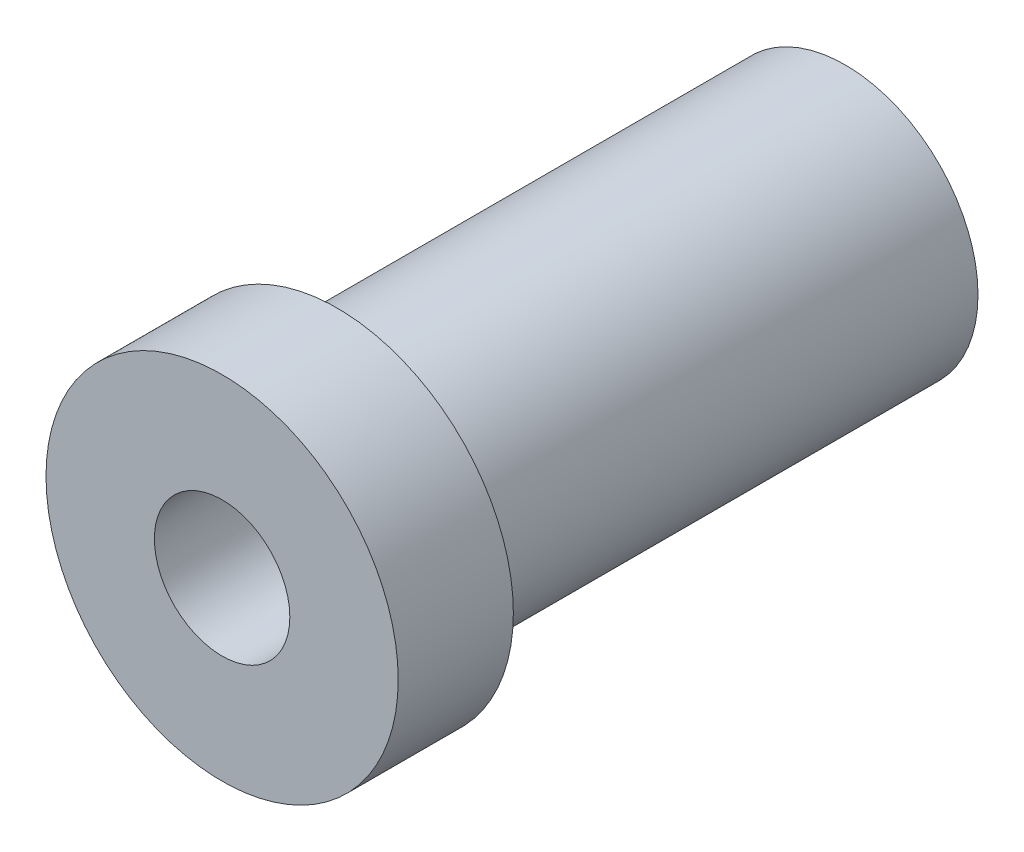
ISO-10303-21;
HEADER;
FILE_DESCRIPTION(('STEP AP214'),'2;1');
FILE_NAME('part.step','',(''),(''),'','','');
FILE_SCHEMA(('AUTOMOTIVE_DESIGN { 1 0 10303 214 1 1 1 1 }'));
ENDSEC;
DATA;
#1=APPLICATION_CONTEXT('core data for automotive mechanical design processes');
#2=APPLICATION_PROTOCOL_DEFINITION('international standard','automotive_design',2000,#1);
#3=PRODUCT_CONTEXT('',#1,'mechanical');
#4=PRODUCT('Part','Part','',(#3));
#5=PRODUCT_RELATED_PRODUCT_CATEGORY('part','',(#4));
#6=PRODUCT_DEFINITION_FORMATION('','',#4);
#7=PRODUCT_DEFINITION_CONTEXT('part definition',#1,'design');
#8=PRODUCT_DEFINITION('design','',#6,#7);
#9=PRODUCT_DEFINITION_SHAPE('','',#8);
#10=(LENGTH_UNIT() NAMED_UNIT(*) SI_UNIT(.MILLI.,.METRE.));
#11=(NAMED_UNIT(*) PLANE_ANGLE_UNIT() SI_UNIT($,.RADIAN.));
#12=(NAMED_UNIT(*) SI_UNIT($,.STERADIAN.) SOLID_ANGLE_UNIT());
#13=UNCERTAINTY_MEASURE_WITH_UNIT(LENGTH_MEASURE(1.E-05),#10,'distance_accuracy_value','');
#14=(GEOMETRIC_REPRESENTATION_CONTEXT(3) GLOBAL_UNCERTAINTY_ASSIGNED_CONTEXT((#13)) GLOBAL_UNIT_ASSIGNED_CONTEXT((#10,
#11,#12)) REPRESENTATION_CONTEXT('',''));
#15=CARTESIAN_POINT('',(0.,0.,0.));
#16=DIRECTION('',(0.,0.,1.));
#17=DIRECTION('',(1.,0.,0.));
#18=AXIS2_PLACEMENT_3D('',#15,#16,#17);
#19=CARTESIAN_POINT('',(0.,4.9,-18.75));
#20=DIRECTION('',(0.,0.,1.));
#21=DIRECTION('',(1.,0.,0.));
#22=AXIS2_PLACEMENT_3D('',#19,#20,#21);
#23=PLANE('',#22);
#24=CARTESIAN_POINT('',(0.,0.,-18.75));
#25=DIRECTION('',(0.,0.,-1.));
#26=DIRECTION('',(-1.,0.,0.));
#27=AXIS2_PLACEMENT_3D('',#24,#25,#26);
#28=CIRCLE('',#27,2.49999999999999);
#29=CARTESIAN_POINT('',(-2.49999999999999,0.,-18.75));
#30=VERTEX_POINT('',#29);
#31=EDGE_CURVE('E66',#30,#30,#28,.T.);
#32=ORIENTED_EDGE('',*,*,#31,.F.);
#33=EDGE_LOOP('',(#32));
#34=FACE_BOUND('',#33,.T.);
#35=CARTESIAN_POINT('',(0.,0.,-18.75));
#36=DIRECTION('',(0.,0.,1.));
#37=DIRECTION('',(1.,0.,0.));
#38=AXIS2_PLACEMENT_3D('',#35,#36,#37);
#39=CIRCLE('',#38,4.9);
#40=CARTESIAN_POINT('',(4.9,0.,-18.75));
#41=VERTEX_POINT('',#40);
#42=EDGE_CURVE('E58',#41,#41,#39,.T.);
#43=ORIENTED_EDGE('',*,*,#42,.F.);
#44=EDGE_LOOP('',(#43));
#45=FACE_BOUND('',#44,.T.);
#46=ADVANCED_FACE('F44',(#34,#45),#23,.F.);
#47=CARTESIAN_POINT('',(0.,0.,4.25));
#48=DIRECTION('',(0.,0.,-1.));
#49=DIRECTION('',(-1.,0.,0.));
#50=AXIS2_PLACEMENT_3D('',#47,#48,#49);
#51=PLANE('',#50);
#52=CARTESIAN_POINT('',(0.,0.,4.25));
#53=DIRECTION('',(0.,0.,1.));
#54=DIRECTION('',(1.,0.,0.));
#55=AXIS2_PLACEMENT_3D('',#52,#53,#54);
#56=CIRCLE('',#55,2.5);
#57=CARTESIAN_POINT('',(2.5,0.,4.25));
#58=VERTEX_POINT('',#57);
#59=EDGE_CURVE('E63',#58,#58,#56,.T.);
#60=ORIENTED_EDGE('',*,*,#59,.F.);
#61=EDGE_LOOP('',(#60));
#62=FACE_BOUND('',#61,.T.);
#63=CARTESIAN_POINT('',(0.,0.,4.24999999999998));
#64=DIRECTION('',(0.,0.,1.));
#65=DIRECTION('',(1.,0.,0.));
#66=AXIS2_PLACEMENT_3D('',#63,#64,#65);
#67=CIRCLE('',#66,6.5);
#68=CARTESIAN_POINT('',(6.5,0.,4.24999999999998));
#69=VERTEX_POINT('',#68);
#70=EDGE_CURVE('E12',#69,#69,#67,.T.);
#71=ORIENTED_EDGE('',*,*,#70,.T.);
#72=EDGE_LOOP('',(#71));
#73=FACE_BOUND('',#72,.T.);
#74=ADVANCED_FACE('F74',(#62,#73),#51,.F.);
#75=CARTESIAN_POINT('',(0.,0.,1000.));
#76=DIRECTION('',(0.,0.,1.));
#77=DIRECTION('',(1.,0.,0.));
#78=AXIS2_PLACEMENT_3D('',#75,#76,#77);
#79=CYLINDRICAL_SURFACE('',#78,6.5);
#80=ORIENTED_EDGE('',*,*,#70,.F.);
#81=EDGE_LOOP('',(#80));
#82=FACE_BOUND('',#81,.T.);
#83=CARTESIAN_POINT('',(0.,0.,0.));
#84=DIRECTION('',(0.,0.,1.));
#85=DIRECTION('',(1.,0.,0.));
#86=AXIS2_PLACEMENT_3D('',#83,#84,#85);
#87=CIRCLE('',#86,6.5);
#88=CARTESIAN_POINT('',(6.5,0.,0.));
#89=VERTEX_POINT('',#88);
#90=EDGE_CURVE('E50',#89,#89,#87,.T.);
#91=ORIENTED_EDGE('',*,*,#90,.T.);
#92=EDGE_LOOP('',(#91));
#93=FACE_BOUND('',#92,.T.);
#94=ADVANCED_FACE('F88',(#82,#93),#79,.T.);
#95=CARTESIAN_POINT('',(0.,6.5,0.));
#96=DIRECTION('',(0.,0.,1.));
#97=DIRECTION('',(1.,0.,0.));
#98=AXIS2_PLACEMENT_3D('',#95,#96,#97);
#99=PLANE('',#98);
#100=ORIENTED_EDGE('',*,*,#90,.F.);
#101=EDGE_LOOP('',(#100));
#102=FACE_BOUND('',#101,.T.);
#103=CARTESIAN_POINT('',(0.,0.,0.));
#104=DIRECTION('',(0.,0.,1.));
#105=DIRECTION('',(1.,0.,0.));
#106=AXIS2_PLACEMENT_3D('',#103,#104,#105);
#107=CIRCLE('',#106,4.9);
#108=CARTESIAN_POINT('',(4.9,0.,0.));
#109=VERTEX_POINT('',#108);
#110=EDGE_CURVE('E54',#109,#109,#107,.T.);
#111=ORIENTED_EDGE('',*,*,#110,.T.);
#112=EDGE_LOOP('',(#111));
#113=FACE_BOUND('',#112,.T.);
#114=ADVANCED_FACE('F79',(#102,#113),#99,.F.);
#115=CARTESIAN_POINT('',(0.,0.,1000.));
#116=DIRECTION('',(0.,0.,1.));
#117=DIRECTION('',(1.,0.,0.));
#118=AXIS2_PLACEMENT_3D('',#115,#116,#117);
#119=CYLINDRICAL_SURFACE('',#118,4.9);
#120=ORIENTED_EDGE('',*,*,#110,.F.);
#121=EDGE_LOOP('',(#120));
#122=FACE_BOUND('',#121,.T.);
#123=ORIENTED_EDGE('',*,*,#42,.T.);
#124=EDGE_LOOP('',(#123));
#125=FACE_BOUND('',#124,.T.);
#126=ADVANCED_FACE('F77',(#122,#125),#119,.T.);
#127=CARTESIAN_POINT('',(0.,0.,4.25));
#128=DIRECTION('',(0.,0.,1.));
#129=DIRECTION('',(1.,0.,0.));
#130=AXIS2_PLACEMENT_3D('',#127,#128,#129);
#131=CYLINDRICAL_SURFACE('',#130,2.5);
#132=ORIENTED_EDGE('',*,*,#59,.T.);
#133=EDGE_LOOP('',(#132));
#134=FACE_BOUND('',#133,.T.);
#135=ORIENTED_EDGE('',*,*,#31,.T.);
#136=EDGE_LOOP('',(#135));
#137=FACE_BOUND('',#136,.T.);
#138=ADVANCED_FACE('F70',(#134,#137),#131,.F.);
#139=CLOSED_SHELL('',(#46,#74,#94,#114,#126,#138));
#140=MANIFOLD_SOLID_BREP('B2',#139);
#141=ADVANCED_BREP_SHAPE_REPRESENTATION('',(#18,#140),#14);
#142=SHAPE_DEFINITION_REPRESENTATION(#9,#141);
ENDSEC;
END-ISO-10303-21;
